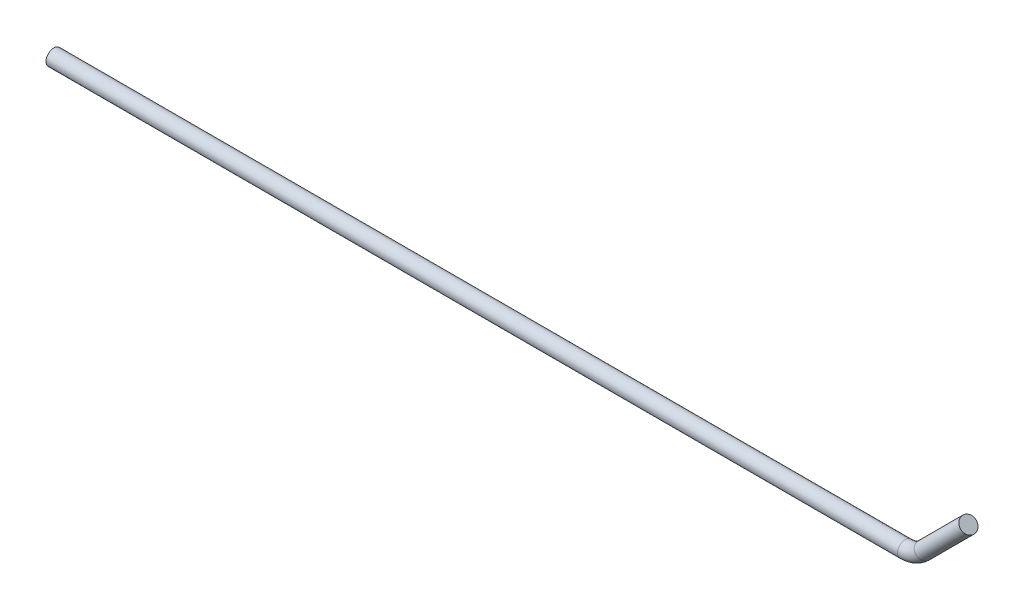
ISO-10303-21;
HEADER;
FILE_DESCRIPTION(('STEP AP214'),'2;1');
FILE_NAME('part.step','',(''),(''),'','','');
FILE_SCHEMA(('AUTOMOTIVE_DESIGN { 1 0 10303 214 1 1 1 1 }'));
ENDSEC;
DATA;
#1=APPLICATION_CONTEXT('core data for automotive mechanical design processes');
#2=APPLICATION_PROTOCOL_DEFINITION('international standard','automotive_design',2000,#1);
#3=PRODUCT_CONTEXT('',#1,'mechanical');
#4=PRODUCT('Part','Part','',(#3));
#5=PRODUCT_RELATED_PRODUCT_CATEGORY('part','',(#4));
#6=PRODUCT_DEFINITION_FORMATION('','',#4);
#7=PRODUCT_DEFINITION_CONTEXT('part definition',#1,'design');
#8=PRODUCT_DEFINITION('design','',#6,#7);
#9=PRODUCT_DEFINITION_SHAPE('','',#8);
#10=(LENGTH_UNIT() NAMED_UNIT(*) SI_UNIT(.MILLI.,.METRE.));
#11=(NAMED_UNIT(*) PLANE_ANGLE_UNIT() SI_UNIT($,.RADIAN.));
#12=(NAMED_UNIT(*) SI_UNIT($,.STERADIAN.) SOLID_ANGLE_UNIT());
#13=UNCERTAINTY_MEASURE_WITH_UNIT(LENGTH_MEASURE(1.E-05),#10,'distance_accuracy_value','');
#14=(GEOMETRIC_REPRESENTATION_CONTEXT(3) GLOBAL_UNCERTAINTY_ASSIGNED_CONTEXT((#13)) GLOBAL_UNIT_ASSIGNED_CONTEXT((#10,
#11,#12)) REPRESENTATION_CONTEXT('',''));
#15=CARTESIAN_POINT('',(0.,0.,0.));
#16=DIRECTION('',(0.,0.,1.));
#17=DIRECTION('',(1.,0.,0.));
#18=AXIS2_PLACEMENT_3D('',#15,#16,#17);
#19=CARTESIAN_POINT('',(0.,0.,0.));
#20=DIRECTION('',(-1.,0.,0.));
#21=DIRECTION('',(0.,-1.,0.));
#22=AXIS2_PLACEMENT_3D('',#19,#20,#21);
#23=PLANE('',#22);
#24=CARTESIAN_POINT('',(0.,0.,0.));
#25=DIRECTION('',(-1.,0.,0.));
#26=DIRECTION('',(0.,-1.,0.));
#27=AXIS2_PLACEMENT_3D('',#24,#25,#26);
#28=CIRCLE('',#27,3.00000000000001);
#29=CARTESIAN_POINT('',(0.,-3.00000000000006,0.));
#30=VERTEX_POINT('',#29);
#31=EDGE_CURVE('E57',#30,#30,#28,.T.);
#32=ORIENTED_EDGE('',*,*,#31,.T.);
#33=EDGE_LOOP('',(#32));
#34=FACE_BOUND('',#33,.T.);
#35=ADVANCED_FACE('F45',(#34),#23,.T.);
#36=CARTESIAN_POINT('',(350.,20.0000000000001,0.));
#37=DIRECTION('',(-0.707106781186543,-0.707106781186552,0.));
#38=DIRECTION('',(0.707106781186552,-0.707106781186543,0.));
#39=AXIS2_PLACEMENT_3D('',#36,#37,#38);
#40=PLANE('',#39);
#41=CARTESIAN_POINT('',(350.,20.0000000000001,0.));
#42=DIRECTION('',(-0.707106781186543,-0.707106781186552,0.));
#43=DIRECTION('',(0.707106781186552,-0.707106781186543,0.));
#44=AXIS2_PLACEMENT_3D('',#41,#42,#43);
#45=CIRCLE('',#44,3.00000000000001);
#46=CARTESIAN_POINT('',(352.12132034356,17.8786796564405,0.));
#47=VERTEX_POINT('',#46);
#48=EDGE_CURVE('E12',#47,#47,#45,.T.);
#49=ORIENTED_EDGE('',*,*,#48,.F.);
#50=EDGE_LOOP('',(#49));
#51=FACE_BOUND('',#50,.T.);
#52=ADVANCED_FACE('F63',(#51),#40,.F.);
#53=CARTESIAN_POINT('',(0.,0.,0.));
#54=DIRECTION('',(1.,0.,0.));
#55=DIRECTION('',(0.,0.,-1.));
#56=AXIS2_PLACEMENT_3D('',#53,#54,#55);
#57=CYLINDRICAL_SURFACE('',#56,3.00000000000001);
#58=CARTESIAN_POINT('',(325.857864376269,0.,0.));
#59=DIRECTION('',(-1.,0.,0.));
#60=DIRECTION('',(0.,-1.,0.));
#61=AXIS2_PLACEMENT_3D('',#58,#59,#60);
#62=CIRCLE('',#61,3.00000000000001);
#63=CARTESIAN_POINT('',(325.857864376269,-3.00000000000006,0.));
#64=VERTEX_POINT('',#63);
#65=EDGE_CURVE('E88',#64,#64,#62,.T.);
#66=ORIENTED_EDGE('',*,*,#65,.T.);
#67=EDGE_LOOP('',(#66));
#68=FACE_BOUND('',#67,.T.);
#69=ORIENTED_EDGE('',*,*,#31,.F.);
#70=EDGE_LOOP('',(#69));
#71=FACE_BOUND('',#70,.T.);
#72=ADVANCED_FACE('F65',(#68,#71),#57,.T.);
#73=CARTESIAN_POINT('',(325.857864376269,10.,0.));
#74=DIRECTION('',(0.,0.,1.));
#75=DIRECTION('',(1.,0.,0.));
#76=AXIS2_PLACEMENT_3D('',#73,#74,#75);
#77=TOROIDAL_SURFACE('',#76,10.0000000000001,3.00000000000001);
#78=CARTESIAN_POINT('',(332.928932188135,2.92893218813386,0.));
#79=DIRECTION('',(-0.707106781186543,-0.707106781186552,0.));
#80=DIRECTION('',(0.707106781186552,-0.707106781186543,0.));
#81=AXIS2_PLACEMENT_3D('',#78,#79,#80);
#82=CIRCLE('',#81,3.00000000000001);
#83=CARTESIAN_POINT('',(335.050252531694,0.807611844574499,0.));
#84=VERTEX_POINT('',#83);
#85=EDGE_CURVE('E52',#84,#84,#82,.T.);
#86=CARTESIAN_POINT('',(325.857864376269,10.,0.));
#87=DIRECTION('',(0.,0.,1.));
#88=DIRECTION('',(1.,0.,0.));
#89=AXIS2_PLACEMENT_3D('',#86,#87,#88);
#90=CIRCLE('',#89,13.0000000000001);
#91=EDGE_CURVE('',#64,#84,#90,.T.);
#92=ORIENTED_EDGE('',*,*,#65,.F.);
#93=ORIENTED_EDGE('',*,*,#85,.T.);
#94=ORIENTED_EDGE('',*,*,#91,.T.);
#95=ORIENTED_EDGE('',*,*,#91,.F.);
#96=EDGE_LOOP('',(#92,#94,#93,#95));
#97=FACE_BOUND('',#96,.T.);
#98=ADVANCED_FACE('F70',(#97),#77,.T.);
#99=CARTESIAN_POINT('',(332.928932188135,2.92893218813454,0.));
#100=DIRECTION('',(0.707106781186546,0.707106781186549,0.));
#101=DIRECTION('',(-0.707106781186549,0.707106781186546,0.));
#102=AXIS2_PLACEMENT_3D('',#99,#100,#101);
#103=CYLINDRICAL_SURFACE('',#102,3.00000000000001);
#104=ORIENTED_EDGE('',*,*,#48,.T.);
#105=EDGE_LOOP('',(#104));
#106=FACE_BOUND('',#105,.T.);
#107=ORIENTED_EDGE('',*,*,#85,.F.);
#108=EDGE_LOOP('',(#107));
#109=FACE_BOUND('',#108,.T.);
#110=ADVANCED_FACE('F60',(#106,#109),#103,.T.);
#111=CLOSED_SHELL('',(#35,#52,#72,#98,#110));
#112=MANIFOLD_SOLID_BREP('B2',#111);
#113=ADVANCED_BREP_SHAPE_REPRESENTATION('',(#18,#112),#14);
#114=SHAPE_DEFINITION_REPRESENTATION(#9,#113);
ENDSEC;
END-ISO-10303-21;
